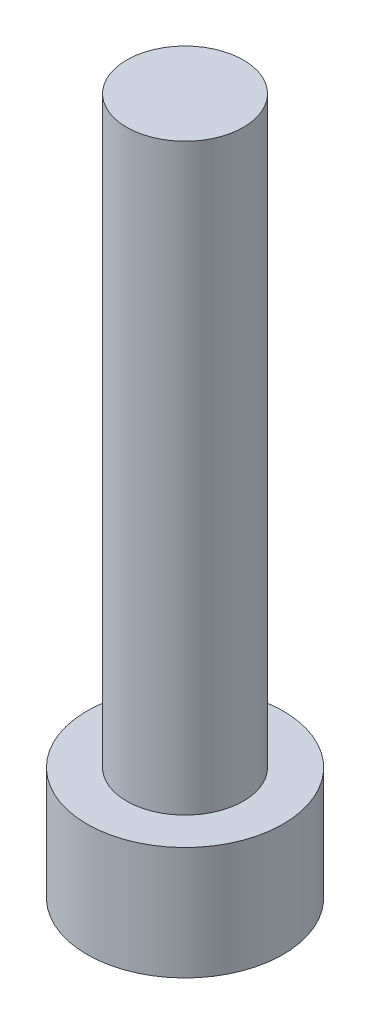
ISO-10303-21;
HEADER;
FILE_DESCRIPTION(('STEP AP214'),'2;1');
FILE_NAME('part.step','',(''),(''),'','','');
FILE_SCHEMA(('AUTOMOTIVE_DESIGN { 1 0 10303 214 1 1 1 1 }'));
ENDSEC;
DATA;
#1=APPLICATION_CONTEXT('core data for automotive mechanical design processes');
#2=APPLICATION_PROTOCOL_DEFINITION('international standard','automotive_design',2000,#1);
#3=PRODUCT_CONTEXT('',#1,'mechanical');
#4=PRODUCT('Part','Part','',(#3));
#5=PRODUCT_RELATED_PRODUCT_CATEGORY('part','',(#4));
#6=PRODUCT_DEFINITION_FORMATION('','',#4);
#7=PRODUCT_DEFINITION_CONTEXT('part definition',#1,'design');
#8=PRODUCT_DEFINITION('design','',#6,#7);
#9=PRODUCT_DEFINITION_SHAPE('','',#8);
#10=(LENGTH_UNIT() NAMED_UNIT(*) SI_UNIT(.MILLI.,.METRE.));
#11=(NAMED_UNIT(*) PLANE_ANGLE_UNIT() SI_UNIT($,.RADIAN.));
#12=(NAMED_UNIT(*) SI_UNIT($,.STERADIAN.) SOLID_ANGLE_UNIT());
#13=UNCERTAINTY_MEASURE_WITH_UNIT(LENGTH_MEASURE(1.E-05),#10,'distance_accuracy_value','');
#14=(GEOMETRIC_REPRESENTATION_CONTEXT(3) GLOBAL_UNCERTAINTY_ASSIGNED_CONTEXT((#13)) GLOBAL_UNIT_ASSIGNED_CONTEXT((#10,
#11,#12)) REPRESENTATION_CONTEXT('',''));
#15=CARTESIAN_POINT('',(0.,0.,0.));
#16=DIRECTION('',(0.,0.,1.));
#17=DIRECTION('',(1.,0.,0.));
#18=AXIS2_PLACEMENT_3D('',#15,#16,#17);
#19=CARTESIAN_POINT('',(0.,4.84,0.));
#20=DIRECTION('',(0.,-1.,0.));
#21=DIRECTION('',(0.,0.,-1.));
#22=AXIS2_PLACEMENT_3D('',#19,#20,#21);
#23=CYLINDRICAL_SURFACE('',#22,4.2);
#24=CARTESIAN_POINT('',(0.,4.84,0.));
#25=DIRECTION('',(0.,1.,0.));
#26=DIRECTION('',(0.,0.,1.));
#27=AXIS2_PLACEMENT_3D('',#24,#25,#26);
#28=CIRCLE('',#27,4.2);
#29=CARTESIAN_POINT('',(0.,4.84,4.2));
#30=VERTEX_POINT('',#29);
#31=EDGE_CURVE('E43',#30,#30,#28,.T.);
#32=ORIENTED_EDGE('',*,*,#31,.F.);
#33=EDGE_LOOP('',(#32));
#34=FACE_BOUND('',#33,.T.);
#35=CARTESIAN_POINT('',(0.,0.,0.));
#36=DIRECTION('',(0.,1.,0.));
#37=DIRECTION('',(0.,0.,1.));
#38=AXIS2_PLACEMENT_3D('',#35,#36,#37);
#39=CIRCLE('',#38,4.2);
#40=CARTESIAN_POINT('',(0.,0.,4.2));
#41=VERTEX_POINT('',#40);
#42=EDGE_CURVE('E38',#41,#41,#39,.T.);
#43=ORIENTED_EDGE('',*,*,#42,.T.);
#44=EDGE_LOOP('',(#43));
#45=FACE_BOUND('',#44,.T.);
#46=ADVANCED_FACE('F35',(#34,#45),#23,.T.);
#47=CARTESIAN_POINT('',(0.,4.84,0.));
#48=DIRECTION('',(0.,1.,0.));
#49=DIRECTION('',(0.,0.,1.));
#50=AXIS2_PLACEMENT_3D('',#47,#48,#49);
#51=PLANE('',#50);
#52=CARTESIAN_POINT('',(0.,4.84,0.));
#53=DIRECTION('',(0.,1.,0.));
#54=DIRECTION('',(0.,0.,1.));
#55=AXIS2_PLACEMENT_3D('',#52,#53,#54);
#56=CIRCLE('',#55,2.5);
#57=CARTESIAN_POINT('',(0.,4.84,2.5));
#58=VERTEX_POINT('',#57);
#59=EDGE_CURVE('E11',#58,#58,#56,.T.);
#60=ORIENTED_EDGE('',*,*,#59,.F.);
#61=EDGE_LOOP('',(#60));
#62=FACE_BOUND('',#61,.T.);
#63=ORIENTED_EDGE('',*,*,#31,.T.);
#64=EDGE_LOOP('',(#63));
#65=FACE_BOUND('',#64,.T.);
#66=ADVANCED_FACE('F155',(#62,#65),#51,.T.);
#67=CARTESIAN_POINT('',(0.,0.,0.));
#68=DIRECTION('',(0.,1.,0.));
#69=DIRECTION('',(0.,0.,1.));
#70=AXIS2_PLACEMENT_3D('',#67,#68,#69);
#71=PLANE('',#70);
#72=DIRECTION('',(-0.5,0.,0.866025403784439));
#73=VECTOR('',#72,1.);
#74=CARTESIAN_POINT('',(2.3,0.,0.));
#75=LINE('',#74,#73);
#76=CARTESIAN_POINT('',(2.3,0.,0.));
#77=VERTEX_POINT('',#76);
#78=CARTESIAN_POINT('',(1.15,0.,1.99185842870421));
#79=VERTEX_POINT('',#78);
#80=EDGE_CURVE('E125',#77,#79,#75,.T.);
#81=ORIENTED_EDGE('',*,*,#80,.F.);
#82=DIRECTION('',(0.5,0.,0.866025403784439));
#83=VECTOR('',#82,1.);
#84=CARTESIAN_POINT('',(1.15,0.,-1.99185842870421));
#85=LINE('',#84,#83);
#86=CARTESIAN_POINT('',(1.15,0.,-1.99185842870421));
#87=VERTEX_POINT('',#86);
#88=EDGE_CURVE('E51',#87,#77,#85,.T.);
#89=ORIENTED_EDGE('',*,*,#88,.F.);
#90=DIRECTION('',(1.,0.,0.));
#91=VECTOR('',#90,1.);
#92=CARTESIAN_POINT('',(-1.15,0.,-1.99185842870421));
#93=LINE('',#92,#91);
#94=CARTESIAN_POINT('',(-1.15,0.,-1.99185842870421));
#95=VERTEX_POINT('',#94);
#96=EDGE_CURVE('E134',#95,#87,#93,.T.);
#97=ORIENTED_EDGE('',*,*,#96,.F.);
#98=DIRECTION('',(0.5,0.,-0.866025403784439));
#99=VECTOR('',#98,1.);
#100=CARTESIAN_POINT('',(-2.3,0.,0.));
#101=LINE('',#100,#99);
#102=CARTESIAN_POINT('',(-2.3,0.,0.));
#103=VERTEX_POINT('',#102);
#104=EDGE_CURVE('E132',#103,#95,#101,.T.);
#105=ORIENTED_EDGE('',*,*,#104,.F.);
#106=DIRECTION('',(-0.5,0.,-0.866025403784439));
#107=VECTOR('',#106,1.);
#108=CARTESIAN_POINT('',(-1.15,0.,1.99185842870421));
#109=LINE('',#108,#107);
#110=CARTESIAN_POINT('',(-1.15,0.,1.99185842870421));
#111=VERTEX_POINT('',#110);
#112=EDGE_CURVE('E99',#111,#103,#109,.T.);
#113=ORIENTED_EDGE('',*,*,#112,.F.);
#114=DIRECTION('',(-1.,0.,0.));
#115=VECTOR('',#114,1.);
#116=CARTESIAN_POINT('',(1.15,0.,1.99185842870421));
#117=LINE('',#116,#115);
#118=EDGE_CURVE('E128',#79,#111,#117,.T.);
#119=ORIENTED_EDGE('',*,*,#118,.F.);
#120=EDGE_LOOP('',(#81,#89,#97,#105,#113,#119));
#121=FACE_BOUND('',#120,.T.);
#122=ORIENTED_EDGE('',*,*,#42,.F.);
#123=EDGE_LOOP('',(#122));
#124=FACE_BOUND('',#123,.T.);
#125=ADVANCED_FACE('F152',(#121,#124),#71,.F.);
#126=CARTESIAN_POINT('',(0.,29.84,0.));
#127=DIRECTION('',(0.,-1.,0.));
#128=DIRECTION('',(0.,0.,-1.));
#129=AXIS2_PLACEMENT_3D('',#126,#127,#128);
#130=CYLINDRICAL_SURFACE('',#129,2.5);
#131=CARTESIAN_POINT('',(0.,29.84,0.));
#132=DIRECTION('',(0.,1.,0.));
#133=DIRECTION('',(0.,0.,1.));
#134=AXIS2_PLACEMENT_3D('',#131,#132,#133);
#135=CIRCLE('',#134,2.5);
#136=CARTESIAN_POINT('',(0.,29.84,2.5));
#137=VERTEX_POINT('',#136);
#138=EDGE_CURVE('E138',#137,#137,#135,.T.);
#139=ORIENTED_EDGE('',*,*,#138,.F.);
#140=EDGE_LOOP('',(#139));
#141=FACE_BOUND('',#140,.T.);
#142=ORIENTED_EDGE('',*,*,#59,.T.);
#143=EDGE_LOOP('',(#142));
#144=FACE_BOUND('',#143,.T.);
#145=ADVANCED_FACE('F154',(#141,#144),#130,.T.);
#146=CARTESIAN_POINT('',(0.,29.84,0.));
#147=DIRECTION('',(0.,1.,0.));
#148=DIRECTION('',(0.,0.,1.));
#149=AXIS2_PLACEMENT_3D('',#146,#147,#148);
#150=PLANE('',#149);
#151=ORIENTED_EDGE('',*,*,#138,.T.);
#152=EDGE_LOOP('',(#151));
#153=FACE_BOUND('',#152,.T.);
#154=ADVANCED_FACE('F161',(#153),#150,.T.);
#155=CARTESIAN_POINT('',(1.15,3.4,-1.99185842870421));
#156=DIRECTION('',(0.866025403784439,0.,-0.5));
#157=DIRECTION('',(-0.5,0.,-0.866025403784439));
#158=AXIS2_PLACEMENT_3D('',#155,#156,#157);
#159=PLANE('',#158);
#160=ORIENTED_EDGE('',*,*,#88,.T.);
#161=DIRECTION('',(0.,-1.,0.));
#162=VECTOR('',#161,1.);
#163=CARTESIAN_POINT('',(2.3,3.4,0.));
#164=LINE('',#163,#162);
#165=CARTESIAN_POINT('',(2.3,3.4,0.));
#166=VERTEX_POINT('',#165);
#167=EDGE_CURVE('E81',#166,#77,#164,.T.);
#168=ORIENTED_EDGE('',*,*,#167,.F.);
#169=DIRECTION('',(0.5,0.,0.866025403784439));
#170=VECTOR('',#169,1.);
#171=CARTESIAN_POINT('',(1.15,3.4,-1.99185842870421));
#172=LINE('',#171,#170);
#173=CARTESIAN_POINT('',(1.15,3.4,-1.99185842870421));
#174=VERTEX_POINT('',#173);
#175=EDGE_CURVE('E136',#174,#166,#172,.T.);
#176=ORIENTED_EDGE('',*,*,#175,.F.);
#177=DIRECTION('',(0.,-1.,0.));
#178=VECTOR('',#177,1.);
#179=CARTESIAN_POINT('',(1.15,3.4,-1.99185842870421));
#180=LINE('',#179,#178);
#181=EDGE_CURVE('E59',#174,#87,#180,.T.);
#182=ORIENTED_EDGE('',*,*,#181,.T.);
#183=EDGE_LOOP('',(#160,#168,#176,#182));
#184=FACE_BOUND('',#183,.T.);
#185=ADVANCED_FACE('F190',(#184),#159,.F.);
#186=CARTESIAN_POINT('',(-1.15,3.4,-1.99185842870421));
#187=DIRECTION('',(0.,0.,-1.));
#188=DIRECTION('',(-1.,0.,0.));
#189=AXIS2_PLACEMENT_3D('',#186,#187,#188);
#190=PLANE('',#189);
#191=ORIENTED_EDGE('',*,*,#96,.T.);
#192=ORIENTED_EDGE('',*,*,#181,.F.);
#193=DIRECTION('',(1.,0.,0.));
#194=VECTOR('',#193,1.);
#195=CARTESIAN_POINT('',(-1.15,3.4,-1.99185842870421));
#196=LINE('',#195,#194);
#197=CARTESIAN_POINT('',(-1.15,3.4,-1.99185842870421));
#198=VERTEX_POINT('',#197);
#199=EDGE_CURVE('E111',#198,#174,#196,.T.);
#200=ORIENTED_EDGE('',*,*,#199,.F.);
#201=DIRECTION('',(0.,-1.,0.));
#202=VECTOR('',#201,1.);
#203=CARTESIAN_POINT('',(-1.15,3.4,-1.99185842870421));
#204=LINE('',#203,#202);
#205=EDGE_CURVE('E103',#198,#95,#204,.T.);
#206=ORIENTED_EDGE('',*,*,#205,.T.);
#207=EDGE_LOOP('',(#191,#192,#200,#206));
#208=FACE_BOUND('',#207,.T.);
#209=ADVANCED_FACE('F204',(#208),#190,.F.);
#210=CARTESIAN_POINT('',(-2.3,3.4,0.));
#211=DIRECTION('',(-0.866025403784439,0.,-0.5));
#212=DIRECTION('',(-0.5,0.,0.866025403784439));
#213=AXIS2_PLACEMENT_3D('',#210,#211,#212);
#214=PLANE('',#213);
#215=ORIENTED_EDGE('',*,*,#104,.T.);
#216=ORIENTED_EDGE('',*,*,#205,.F.);
#217=DIRECTION('',(0.5,0.,-0.866025403784439));
#218=VECTOR('',#217,1.);
#219=CARTESIAN_POINT('',(-2.3,3.4,0.));
#220=LINE('',#219,#218);
#221=CARTESIAN_POINT('',(-2.3,3.4,0.));
#222=VERTEX_POINT('',#221);
#223=EDGE_CURVE('E107',#222,#198,#220,.T.);
#224=ORIENTED_EDGE('',*,*,#223,.F.);
#225=DIRECTION('',(0.,-1.,0.));
#226=VECTOR('',#225,1.);
#227=CARTESIAN_POINT('',(-2.3,3.4,0.));
#228=LINE('',#227,#226);
#229=EDGE_CURVE('E92',#222,#103,#228,.T.);
#230=ORIENTED_EDGE('',*,*,#229,.T.);
#231=EDGE_LOOP('',(#215,#216,#224,#230));
#232=FACE_BOUND('',#231,.T.);
#233=ADVANCED_FACE('F108',(#232),#214,.F.);
#234=CARTESIAN_POINT('',(-1.15,3.4,1.99185842870421));
#235=DIRECTION('',(-0.866025403784439,0.,0.5));
#236=DIRECTION('',(0.5,0.,0.866025403784439));
#237=AXIS2_PLACEMENT_3D('',#234,#235,#236);
#238=PLANE('',#237);
#239=ORIENTED_EDGE('',*,*,#112,.T.);
#240=ORIENTED_EDGE('',*,*,#229,.F.);
#241=DIRECTION('',(-0.5,0.,-0.866025403784439));
#242=VECTOR('',#241,1.);
#243=CARTESIAN_POINT('',(-1.15,3.4,1.99185842870421));
#244=LINE('',#243,#242);
#245=CARTESIAN_POINT('',(-1.15,3.4,1.99185842870421));
#246=VERTEX_POINT('',#245);
#247=EDGE_CURVE('E96',#246,#222,#244,.T.);
#248=ORIENTED_EDGE('',*,*,#247,.F.);
#249=DIRECTION('',(0.,-1.,0.));
#250=VECTOR('',#249,1.);
#251=CARTESIAN_POINT('',(-1.15,3.4,1.99185842870421));
#252=LINE('',#251,#250);
#253=EDGE_CURVE('E104',#246,#111,#252,.T.);
#254=ORIENTED_EDGE('',*,*,#253,.T.);
#255=EDGE_LOOP('',(#239,#240,#248,#254));
#256=FACE_BOUND('',#255,.T.);
#257=ADVANCED_FACE('F94',(#256),#238,.F.);
#258=CARTESIAN_POINT('',(1.15,3.4,1.99185842870421));
#259=DIRECTION('',(0.,0.,1.));
#260=DIRECTION('',(1.,0.,0.));
#261=AXIS2_PLACEMENT_3D('',#258,#259,#260);
#262=PLANE('',#261);
#263=ORIENTED_EDGE('',*,*,#118,.T.);
#264=ORIENTED_EDGE('',*,*,#253,.F.);
#265=DIRECTION('',(-1.,0.,0.));
#266=VECTOR('',#265,1.);
#267=CARTESIAN_POINT('',(1.15,3.4,1.99185842870421));
#268=LINE('',#267,#266);
#269=CARTESIAN_POINT('',(1.15,3.4,1.99185842870421));
#270=VERTEX_POINT('',#269);
#271=EDGE_CURVE('E117',#270,#246,#268,.T.);
#272=ORIENTED_EDGE('',*,*,#271,.F.);
#273=DIRECTION('',(0.,-1.,0.));
#274=VECTOR('',#273,1.);
#275=CARTESIAN_POINT('',(1.15,3.4,1.99185842870421));
#276=LINE('',#275,#274);
#277=EDGE_CURVE('E141',#270,#79,#276,.T.);
#278=ORIENTED_EDGE('',*,*,#277,.T.);
#279=EDGE_LOOP('',(#263,#264,#272,#278));
#280=FACE_BOUND('',#279,.T.);
#281=ADVANCED_FACE('F229',(#280),#262,.F.);
#282=CARTESIAN_POINT('',(2.3,3.4,0.));
#283=DIRECTION('',(0.866025403784439,0.,0.5));
#284=DIRECTION('',(0.5,0.,-0.866025403784439));
#285=AXIS2_PLACEMENT_3D('',#282,#283,#284);
#286=PLANE('',#285);
#287=ORIENTED_EDGE('',*,*,#80,.T.);
#288=ORIENTED_EDGE('',*,*,#277,.F.);
#289=DIRECTION('',(-0.5,0.,0.866025403784439));
#290=VECTOR('',#289,1.);
#291=CARTESIAN_POINT('',(2.3,3.4,0.));
#292=LINE('',#291,#290);
#293=EDGE_CURVE('E119',#166,#270,#292,.T.);
#294=ORIENTED_EDGE('',*,*,#293,.F.);
#295=ORIENTED_EDGE('',*,*,#167,.T.);
#296=EDGE_LOOP('',(#287,#288,#294,#295));
#297=FACE_BOUND('',#296,.T.);
#298=ADVANCED_FACE('F238',(#297),#286,.F.);
#299=CARTESIAN_POINT('',(0.,3.4,0.));
#300=DIRECTION('',(0.,-1.,0.));
#301=DIRECTION('',(0.,0.,-1.));
#302=AXIS2_PLACEMENT_3D('',#299,#300,#301);
#303=PLANE('',#302);
#304=ORIENTED_EDGE('',*,*,#175,.T.);
#305=ORIENTED_EDGE('',*,*,#293,.T.);
#306=ORIENTED_EDGE('',*,*,#271,.T.);
#307=ORIENTED_EDGE('',*,*,#247,.T.);
#308=ORIENTED_EDGE('',*,*,#223,.T.);
#309=ORIENTED_EDGE('',*,*,#199,.T.);
#310=EDGE_LOOP('',(#304,#305,#306,#307,#308,#309));
#311=FACE_BOUND('',#310,.T.);
#312=ADVANCED_FACE('F114',(#311),#303,.T.);
#313=CLOSED_SHELL('',(#46,#66,#125,#145,#154,#185,#209,#233,#257,#281,#298,#312));
#314=MANIFOLD_SOLID_BREP('B2',#313);
#315=ADVANCED_BREP_SHAPE_REPRESENTATION('',(#18,#314),#14);
#316=SHAPE_DEFINITION_REPRESENTATION(#9,#315);
ENDSEC;
END-ISO-10303-21;
